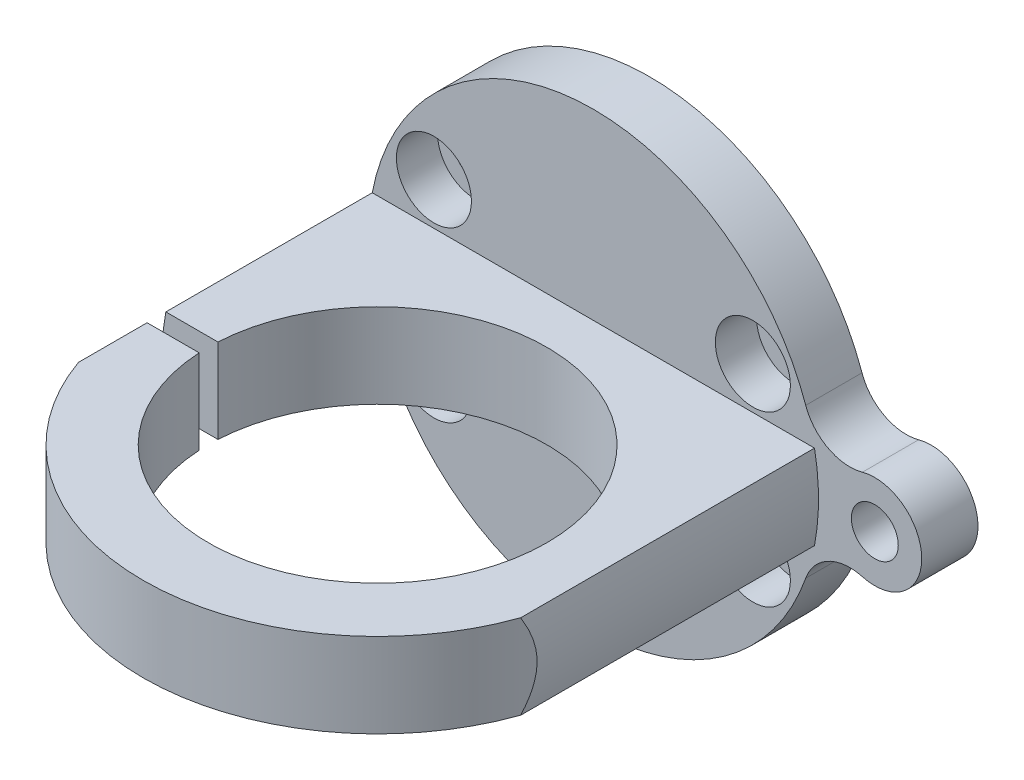
ISO-10303-21;
HEADER;
FILE_DESCRIPTION(('STEP AP214'),'2;1');
FILE_NAME('part.step','',(''),(''),'','','');
FILE_SCHEMA(('AUTOMOTIVE_DESIGN { 1 0 10303 214 1 1 1 1 }'));
ENDSEC;
DATA;
#1=APPLICATION_CONTEXT('core data for automotive mechanical design processes');
#2=APPLICATION_PROTOCOL_DEFINITION('international standard','automotive_design',2000,#1);
#3=PRODUCT_CONTEXT('',#1,'mechanical');
#4=PRODUCT('Part','Part','',(#3));
#5=PRODUCT_RELATED_PRODUCT_CATEGORY('part','',(#4));
#6=PRODUCT_DEFINITION_FORMATION('','',#4);
#7=PRODUCT_DEFINITION_CONTEXT('part definition',#1,'design');
#8=PRODUCT_DEFINITION('design','',#6,#7);
#9=PRODUCT_DEFINITION_SHAPE('','',#8);
#10=(LENGTH_UNIT() NAMED_UNIT(*) SI_UNIT(.MILLI.,.METRE.));
#11=(NAMED_UNIT(*) PLANE_ANGLE_UNIT() SI_UNIT($,.RADIAN.));
#12=(NAMED_UNIT(*) SI_UNIT($,.STERADIAN.) SOLID_ANGLE_UNIT());
#13=UNCERTAINTY_MEASURE_WITH_UNIT(LENGTH_MEASURE(1.E-05),#10,'distance_accuracy_value','');
#14=(GEOMETRIC_REPRESENTATION_CONTEXT(3) GLOBAL_UNCERTAINTY_ASSIGNED_CONTEXT((#13)) GLOBAL_UNIT_ASSIGNED_CONTEXT((#10,
#11,#12)) REPRESENTATION_CONTEXT('',''));
#15=CARTESIAN_POINT('',(0.,0.,0.));
#16=DIRECTION('',(0.,0.,1.));
#17=DIRECTION('',(1.,0.,0.));
#18=AXIS2_PLACEMENT_3D('',#15,#16,#17);
#19=CARTESIAN_POINT('',(0.,0.,-6.));
#20=DIRECTION('',(0.,0.,1.));
#21=DIRECTION('',(1.,0.,0.));
#22=AXIS2_PLACEMENT_3D('',#19,#20,#21);
#23=CYLINDRICAL_SURFACE('',#22,24.);
#24=DIRECTION('',(0.,0.,1.));
#25=VECTOR('',#24,1.);
#26=CARTESIAN_POINT('',(23.5743504682526,-4.5,-6.));
#27=LINE('',#26,#25);
#28=CARTESIAN_POINT('',(23.5743504682526,-4.5,31.3216584885466));
#29=VERTEX_POINT('',#28);
#30=CARTESIAN_POINT('',(23.5743504682526,-4.5,0.));
#31=VERTEX_POINT('',#30);
#32=EDGE_CURVE('E219',#29,#31,#27,.F.);
#33=ORIENTED_EDGE('',*,*,#32,.T.);
#34=CARTESIAN_POINT('',(0.,0.,0.));
#35=DIRECTION('',(0.,0.,1.));
#36=DIRECTION('',(-1.,0.,0.));
#37=AXIS2_PLACEMENT_3D('',#34,#35,#36);
#38=CIRCLE('',#37,24.);
#39=CARTESIAN_POINT('',(23.5743504682526,4.5,0.));
#40=VERTEX_POINT('',#39);
#41=EDGE_CURVE('E161',#31,#40,#38,.T.);
#42=ORIENTED_EDGE('',*,*,#41,.T.);
#43=DIRECTION('',(0.,0.,1.));
#44=VECTOR('',#43,1.);
#45=CARTESIAN_POINT('',(23.5743504682526,4.5,-6.));
#46=LINE('',#45,#44);
#47=CARTESIAN_POINT('',(23.5743504682526,4.5,31.3216584885466));
#48=VERTEX_POINT('',#47);
#49=EDGE_CURVE('E218',#48,#40,#46,.F.);
#50=ORIENTED_EDGE('',*,*,#49,.F.);
#51=CARTESIAN_POINT('',(23.5743504682526,4.5,31.3216584885466));
#52=CARTESIAN_POINT('',(23.6157573192222,4.28301573047034,31.2044104124574));
#53=CARTESIAN_POINT('',(23.6546469507852,4.06307747692704,31.0913980349118));
#54=CARTESIAN_POINT('',(23.7270788362601,3.6162494982413,30.8764465440462));
#55=CARTESIAN_POINT('',(23.7606058100089,3.3893420306107,30.7745393273754));
#56=CARTESIAN_POINT('',(23.8221387533765,2.92591145786183,30.5839248774555));
#57=CARTESIAN_POINT('',(23.8500717825218,2.68930443477932,30.4953953221107));
#58=CARTESIAN_POINT('',(23.8992990807367,2.20942829175013,30.3369201471838));
#59=CARTESIAN_POINT('',(23.9206002093363,1.96616634046176,30.2669553367951));
#60=CARTESIAN_POINT('',(23.9521526056305,1.52702529743059,30.1621717967941));
#61=CARTESIAN_POINT('',(23.9637975166772,1.33228309402099,30.1230239325422));
#62=CARTESIAN_POINT('',(23.9823829053702,0.940112768312964,30.0601979514931));
#63=CARTESIAN_POINT('',(23.9893247646182,0.742685452212207,30.0365152916022));
#64=CARTESIAN_POINT('',(23.9982882648339,0.347726186835377,30.0058846337755));
#65=CARTESIAN_POINT('',(24.0003422165771,0.150203606678098,29.9988267434912));
#66=CARTESIAN_POINT('',(23.9995647437288,-0.244711817262284,30.0014922486172));
#67=CARTESIAN_POINT('',(23.9967334300783,-0.442104663889715,30.0112152629441));
#68=CARTESIAN_POINT('',(23.9862803764371,-0.834761147924739,30.0468922230931));
#69=CARTESIAN_POINT('',(23.9786709585535,-1.03002895178623,30.0728044182715));
#70=CARTESIAN_POINT('',(23.9588737736743,-1.4177874423982,30.1395776867656));
#71=CARTESIAN_POINT('',(23.9466839545981,-1.61027684418988,30.1804454601649));
#72=CARTESIAN_POINT('',(23.9034802076835,-2.18431462097293,30.3234951807389));
#73=CARTESIAN_POINT('',(23.8658903015328,-2.56040118760636,30.4459095987706));
#74=CARTESIAN_POINT('',(23.7872793809115,-3.20017617811185,30.6926830116748));
#75=CARTESIAN_POINT('',(23.7496461115302,-3.46782812056137,30.8083908153243));
#76=CARTESIAN_POINT('',(23.6672030505266,-3.99155750688383,31.0548499962851));
#77=CARTESIAN_POINT('',(23.6224722181626,-4.24772656697199,31.1854318507251));
#78=CARTESIAN_POINT('',(23.5743504682526,-4.5,31.3216584885466));
#79=B_SPLINE_CURVE_WITH_KNOTS('',3,(#51,#52,#53,#54,#55,#56,#57,#58,#59,#60,#61,#62,#63,#64,#65,
#66,#67,#68,#69,#70,#71,#72,#73,#74,#75,#76,#77,#78),.UNSPECIFIED.,.F.,.F.,(4,2,2,2,2,2,2,2,2,2,
2,2,2,4),(0.,0.750439495083586,1.50298057284552,2.26477314161382,3.02577513253489,
3.62211160634237,4.2182728200918,4.81048211830474,5.40267796800572,5.99335285900303,
6.58429269634364,7.77223830948735,8.65367393881817,9.5259146224551),.UNSPECIFIED.);
#80=EDGE_CURVE('E211',#48,#29,#79,.T.);
#81=ORIENTED_EDGE('',*,*,#80,.T.);
#82=EDGE_LOOP('',(#33,#42,#50,#81));
#83=FACE_BOUND('',#82,.T.);
#84=ADVANCED_FACE('F36',(#83),#23,.T.);
#85=CARTESIAN_POINT('',(0.,0.,-6.));
#86=DIRECTION('',(0.,0.,1.));
#87=DIRECTION('',(1.,0.,0.));
#88=AXIS2_PLACEMENT_3D('',#85,#86,#87);
#89=PLANE('',#88);
#90=CARTESIAN_POINT('',(30.,0.,-6.));
#91=DIRECTION('',(0.,0.,1.));
#92=DIRECTION('',(1.,0.,0.));
#93=AXIS2_PLACEMENT_3D('',#90,#91,#92);
#94=CIRCLE('',#93,2.5);
#95=CARTESIAN_POINT('',(32.5,0.,-6.));
#96=VERTEX_POINT('',#95);
#97=EDGE_CURVE('E170',#96,#96,#94,.T.);
#98=ORIENTED_EDGE('',*,*,#97,.T.);
#99=EDGE_LOOP('',(#98));
#100=FACE_BOUND('',#99,.T.);
#101=CARTESIAN_POINT('',(17.,9.,-6.));
#102=DIRECTION('',(0.,0.,1.));
#103=DIRECTION('',(1.,0.,0.));
#104=AXIS2_PLACEMENT_3D('',#101,#102,#103);
#105=CIRCLE('',#104,2.25);
#106=CARTESIAN_POINT('',(19.25,9.,-6.));
#107=VERTEX_POINT('',#106);
#108=EDGE_CURVE('E249',#107,#107,#105,.T.);
#109=ORIENTED_EDGE('',*,*,#108,.T.);
#110=EDGE_LOOP('',(#109));
#111=FACE_BOUND('',#110,.T.);
#112=CARTESIAN_POINT('',(-17.,-9.,-6.));
#113=DIRECTION('',(0.,0.,1.));
#114=DIRECTION('',(1.,0.,0.));
#115=AXIS2_PLACEMENT_3D('',#112,#113,#114);
#116=CIRCLE('',#115,2.25);
#117=CARTESIAN_POINT('',(-14.75,-9.,-6.));
#118=VERTEX_POINT('',#117);
#119=EDGE_CURVE('E261',#118,#118,#116,.T.);
#120=ORIENTED_EDGE('',*,*,#119,.T.);
#121=EDGE_LOOP('',(#120));
#122=FACE_BOUND('',#121,.T.);
#123=CARTESIAN_POINT('',(-17.,9.,-6.));
#124=DIRECTION('',(0.,0.,1.));
#125=DIRECTION('',(1.,0.,0.));
#126=AXIS2_PLACEMENT_3D('',#123,#124,#125);
#127=CIRCLE('',#126,2.25);
#128=CARTESIAN_POINT('',(-14.75,9.,-6.));
#129=VERTEX_POINT('',#128);
#130=EDGE_CURVE('E273',#129,#129,#127,.T.);
#131=ORIENTED_EDGE('',*,*,#130,.T.);
#132=EDGE_LOOP('',(#131));
#133=FACE_BOUND('',#132,.T.);
#134=CARTESIAN_POINT('',(17.,-9.,-6.));
#135=DIRECTION('',(0.,0.,1.));
#136=DIRECTION('',(1.,0.,0.));
#137=AXIS2_PLACEMENT_3D('',#134,#135,#136);
#138=CIRCLE('',#137,2.25);
#139=CARTESIAN_POINT('',(19.25,-9.,-6.));
#140=VERTEX_POINT('',#139);
#141=EDGE_CURVE('E285',#140,#140,#138,.T.);
#142=ORIENTED_EDGE('',*,*,#141,.T.);
#143=EDGE_LOOP('',(#142));
#144=FACE_BOUND('',#143,.T.);
#145=CARTESIAN_POINT('',(0.,0.,-6.));
#146=DIRECTION('',(0.,0.,1.));
#147=DIRECTION('',(1.,0.,0.));
#148=AXIS2_PLACEMENT_3D('',#145,#146,#147);
#149=CIRCLE('',#148,24.);
#150=CARTESIAN_POINT('',(22.6344827586207,7.97998685773998,-6.));
#151=VERTEX_POINT('',#150);
#152=CARTESIAN_POINT('',(22.6344827586207,-7.97998685773998,-6.));
#153=VERTEX_POINT('',#152);
#154=EDGE_CURVE('E315',#151,#153,#149,.T.);
#155=ORIENTED_EDGE('',*,*,#154,.F.);
#156=CARTESIAN_POINT('',(27.35,9.64248411976914,-6.));
#157=DIRECTION('',(0.,0.,1.));
#158=DIRECTION('',(1.,0.,0.));
#159=AXIS2_PLACEMENT_3D('',#156,#157,#158);
#160=CIRCLE('',#159,5.);
#161=CARTESIAN_POINT('',(28.675,4.82124205988457,-6.));
#162=VERTEX_POINT('',#161);
#163=EDGE_CURVE('E168',#151,#162,#160,.T.);
#164=ORIENTED_EDGE('',*,*,#163,.T.);
#165=CARTESIAN_POINT('',(30.,0.,-6.));
#166=DIRECTION('',(0.,0.,-1.));
#167=DIRECTION('',(-1.,0.,0.));
#168=AXIS2_PLACEMENT_3D('',#165,#166,#167);
#169=CIRCLE('',#168,5.);
#170=CARTESIAN_POINT('',(28.675,-4.82124205988457,-6.));
#171=VERTEX_POINT('',#170);
#172=EDGE_CURVE('E146',#162,#171,#169,.T.);
#173=ORIENTED_EDGE('',*,*,#172,.T.);
#174=CARTESIAN_POINT('',(27.35,-9.64248411976914,-6.));
#175=DIRECTION('',(0.,0.,1.));
#176=DIRECTION('',(-1.,0.,0.));
#177=AXIS2_PLACEMENT_3D('',#174,#175,#176);
#178=CIRCLE('',#177,5.);
#179=EDGE_CURVE('E163',#171,#153,#178,.T.);
#180=ORIENTED_EDGE('',*,*,#179,.T.);
#181=EDGE_LOOP('',(#155,#164,#173,#180));
#182=FACE_BOUND('',#181,.T.);
#183=ADVANCED_FACE('F338',(#100,#111,#122,#133,#144,#182),#89,.F.);
#184=CARTESIAN_POINT('',(0.,4.5,24.));
#185=DIRECTION('',(0.,0.,-1.));
#186=DIRECTION('',(-1.,0.,0.));
#187=AXIS2_PLACEMENT_3D('',#184,#185,#186);
#188=PLANE('',#187);
#189=CARTESIAN_POINT('',(-21.5,0.,24.));
#190=DIRECTION('',(0.,0.,-1.));
#191=DIRECTION('',(-1.,0.,0.));
#192=AXIS2_PLACEMENT_3D('',#189,#190,#191);
#193=CIRCLE('',#192,1.69999999999999);
#194=CARTESIAN_POINT('',(-23.2,0.,24.));
#195=VERTEX_POINT('',#194);
#196=EDGE_CURVE('E239',#195,#195,#193,.T.);
#197=ORIENTED_EDGE('',*,*,#196,.F.);
#198=EDGE_LOOP('',(#197));
#199=FACE_BOUND('',#198,.T.);
#200=DIRECTION('',(1.,0.,0.));
#201=VECTOR('',#200,1.);
#202=CARTESIAN_POINT('',(0.,-4.5,24.));
#203=LINE('',#202,#201);
#204=CARTESIAN_POINT('',(-23.5743504682526,-4.5,24.));
#205=VERTEX_POINT('',#204);
#206=CARTESIAN_POINT('',(-18.0222778804456,-4.5,24.));
#207=VERTEX_POINT('',#206);
#208=EDGE_CURVE('E288',#205,#207,#203,.T.);
#209=ORIENTED_EDGE('',*,*,#208,.F.);
#210=CARTESIAN_POINT('',(0.,0.,24.));
#211=DIRECTION('',(0.,0.,-1.));
#212=DIRECTION('',(-1.,0.,0.));
#213=AXIS2_PLACEMENT_3D('',#210,#211,#212);
#214=CIRCLE('',#213,24.);
#215=CARTESIAN_POINT('',(-23.5743504682526,4.5,24.));
#216=VERTEX_POINT('',#215);
#217=EDGE_CURVE('E341',#205,#216,#214,.T.);
#218=ORIENTED_EDGE('',*,*,#217,.T.);
#219=DIRECTION('',(1.,0.,0.));
#220=VECTOR('',#219,1.);
#221=CARTESIAN_POINT('',(0.,4.5,24.));
#222=LINE('',#221,#220);
#223=CARTESIAN_POINT('',(-18.0222778804456,4.5,24.));
#224=VERTEX_POINT('',#223);
#225=EDGE_CURVE('E298',#216,#224,#222,.T.);
#226=ORIENTED_EDGE('',*,*,#225,.T.);
#227=DIRECTION('',(0.,-1.,0.));
#228=VECTOR('',#227,1.);
#229=CARTESIAN_POINT('',(-18.0222778804456,4.5,24.));
#230=LINE('',#229,#228);
#231=EDGE_CURVE('E308',#224,#207,#230,.T.);
#232=ORIENTED_EDGE('',*,*,#231,.T.);
#233=EDGE_LOOP('',(#209,#218,#226,#232));
#234=FACE_BOUND('',#233,.T.);
#235=ADVANCED_FACE('F195',(#199,#234),#188,.T.);
#236=CARTESIAN_POINT('',(0.,4.5,23.));
#237=DIRECTION('',(0.,-1.,0.));
#238=DIRECTION('',(0.,0.,-1.));
#239=AXIS2_PLACEMENT_3D('',#236,#237,#238);
#240=CYLINDRICAL_SURFACE('',#239,25.);
#241=ORIENTED_EDGE('',*,*,#80,.F.);
#242=CARTESIAN_POINT('',(0.,4.5,23.));
#243=DIRECTION('',(0.,1.,0.));
#244=DIRECTION('',(0.,0.,1.));
#245=AXIS2_PLACEMENT_3D('',#242,#243,#244);
#246=CIRCLE('',#245,25.);
#247=CARTESIAN_POINT('',(-23.5743504682526,4.5,31.3216584885466));
#248=VERTEX_POINT('',#247);
#249=EDGE_CURVE('E300',#248,#48,#246,.T.);
#250=ORIENTED_EDGE('',*,*,#249,.F.);
#251=CARTESIAN_POINT('',(-23.5743504682526,-4.5,31.3216584885466));
#252=CARTESIAN_POINT('',(-23.6157573192222,-4.28301573047034,31.2044104124574));
#253=CARTESIAN_POINT('',(-23.6546469507852,-4.06307747692704,31.0913980349118));
#254=CARTESIAN_POINT('',(-23.7270788362601,-3.6162494982413,30.8764465440462));
#255=CARTESIAN_POINT('',(-23.7606058100089,-3.3893420306107,30.7745393273754));
#256=CARTESIAN_POINT('',(-23.8221387533765,-2.92591145786183,30.5839248774555));
#257=CARTESIAN_POINT('',(-23.8500717825218,-2.68930443477932,30.4953953221107));
#258=CARTESIAN_POINT('',(-23.8992990807367,-2.20942829175013,30.3369201471838));
#259=CARTESIAN_POINT('',(-23.9206002093363,-1.96616634046176,30.2669553367951));
#260=CARTESIAN_POINT('',(-23.9521526056305,-1.52702529743059,30.1621717967941));
#261=CARTESIAN_POINT('',(-23.9637975166772,-1.33228309402099,30.1230239325422));
#262=CARTESIAN_POINT('',(-23.9823829053702,-0.940112768312964,30.0601979514931));
#263=CARTESIAN_POINT('',(-23.9893247646182,-0.742685452212207,30.0365152916022));
#264=CARTESIAN_POINT('',(-23.9982882648339,-0.347726186835377,30.0058846337755));
#265=CARTESIAN_POINT('',(-24.0003422165771,-0.150203606678098,29.9988267434912));
#266=CARTESIAN_POINT('',(-23.9995647437288,0.244711817262284,30.0014922486172));
#267=CARTESIAN_POINT('',(-23.9967334300783,0.442104663889715,30.0112152629441));
#268=CARTESIAN_POINT('',(-23.9862803764371,0.834761147924739,30.0468922230931));
#269=CARTESIAN_POINT('',(-23.9786709585535,1.03002895178623,30.0728044182715));
#270=CARTESIAN_POINT('',(-23.9588737736743,1.4177874423982,30.1395776867656));
#271=CARTESIAN_POINT('',(-23.9466839545981,1.61027684418988,30.1804454601649));
#272=CARTESIAN_POINT('',(-23.9034802076835,2.18431462097293,30.3234951807389));
#273=CARTESIAN_POINT('',(-23.8658903015328,2.56040118760636,30.4459095987706));
#274=CARTESIAN_POINT('',(-23.7872793809115,3.20017617811185,30.6926830116748));
#275=CARTESIAN_POINT('',(-23.7496461115302,3.46782812056137,30.8083908153243));
#276=CARTESIAN_POINT('',(-23.6672030505266,3.99155750688383,31.0548499962851));
#277=CARTESIAN_POINT('',(-23.6224722181626,4.24772656697199,31.1854318507251));
#278=CARTESIAN_POINT('',(-23.5743504682526,4.5,31.3216584885466));
#279=B_SPLINE_CURVE_WITH_KNOTS('',3,(#251,#252,#253,#254,#255,#256,#257,#258,#259,#260,#261,
#262,#263,#264,#265,#266,#267,#268,#269,#270,#271,#272,#273,#274,#275,#276,#277,#278),
.UNSPECIFIED.,.F.,.F.,(4,2,2,2,2,2,2,2,2,2,2,2,2,4),(0.,0.750439495083586,1.50298057284552,
2.26477314161382,3.02577513253489,3.62211160634237,4.2182728200918,4.81048211830474,
5.40267796800572,5.99335285900303,6.58429269634364,7.77223830948735,8.65367393881817,
9.5259146224551),.UNSPECIFIED.);
#280=CARTESIAN_POINT('',(-23.8997093023256,2.1917790181339,30.335113854899));
#281=VERTEX_POINT('',#280);
#282=EDGE_CURVE('E187',#281,#248,#279,.T.);
#283=ORIENTED_EDGE('',*,*,#282,.F.);
#284=CARTESIAN_POINT('',(-24.3647286050963,1.53487133634801,28.6));
#285=CARTESIAN_POINT('',(-24.3385334363902,1.58373798265813,28.7139775703707));
#286=CARTESIAN_POINT('',(-24.3114208287813,1.63136154234516,28.8282706371185));
#287=CARTESIAN_POINT('',(-24.2553668314557,1.72436120298112,29.0573145974324));
#288=CARTESIAN_POINT('',(-24.2264255470778,1.76973743311678,29.1720654642713));
#289=CARTESIAN_POINT('',(-24.1667192479999,1.85848378673641,29.4018574256571));
#290=CARTESIAN_POINT('',(-24.1359543539079,1.90185404255247,29.5168985005297));
#291=CARTESIAN_POINT('',(-24.0725976603706,1.98671714979433,29.7471699811742));
#292=CARTESIAN_POINT('',(-24.0400058270598,2.02820996639259,29.8624003904173));
#293=CARTESIAN_POINT('',(-23.9393100191523,2.15021375507858,30.2088397530666));
#294=CARTESIAN_POINT('',(-23.8684386531629,2.22802365182075,30.4402071163822));
#295=CARTESIAN_POINT('',(-23.7192892753877,2.37662100906926,30.9028092297959));
#296=CARTESIAN_POINT('',(-23.6410110560834,2.44740827270812,31.1340439759957));
#297=CARTESIAN_POINT('',(-23.4766649904604,2.5819797772045,31.5969035437314));
#298=CARTESIAN_POINT('',(-23.3905674025857,2.64573504711592,31.8285262592054));
#299=CARTESIAN_POINT('',(-23.2107968478142,2.76538087649977,32.2908790842952));
#300=CARTESIAN_POINT('',(-23.1171236246241,2.82127116971447,32.5216091634351));
#301=CARTESIAN_POINT('',(-22.9222892745375,2.92433317144847,32.9815305834762));
#302=CARTESIAN_POINT('',(-22.821137047292,2.97151501598587,33.2107234102247));
#303=CARTESIAN_POINT('',(-22.6112750435608,3.05620191689344,33.6673974729581));
#304=CARTESIAN_POINT('',(-22.5025667300751,3.0937088399212,33.8948790308764));
#305=CARTESIAN_POINT('',(-22.2927129469009,3.15346785906082,34.3173712534795));
#306=CARTESIAN_POINT('',(-22.1925030920029,3.17708991961985,34.5126522286489));
#307=CARTESIAN_POINT('',(-21.986579255437,3.21507441060415,34.9012044152304));
#308=CARTESIAN_POINT('',(-21.8808656745912,3.22943751431862,35.0944757717714));
#309=CARTESIAN_POINT('',(-21.6639482278379,3.24768976941905,35.478867149361));
#310=CARTESIAN_POINT('',(-21.552735448731,3.25156130884696,35.6699830172825));
#311=CARTESIAN_POINT('',(-21.3253237949323,3.24729477918506,36.0491156352255));
#312=CARTESIAN_POINT('',(-21.2091250542498,3.23915703267695,36.2371324683531));
#313=CARTESIAN_POINT('',(-20.9706323710269,3.20888181418307,36.6118539648462));
#314=CARTESIAN_POINT('',(-20.8482762034527,3.18655154658656,36.7985041706439));
#315=CARTESIAN_POINT('',(-20.5998218237209,3.12546875389362,37.1667451562976));
#316=CARTESIAN_POINT('',(-20.4737221190001,3.08670959448353,37.3483338606121));
#317=CARTESIAN_POINT('',(-20.219847768322,2.99032755726669,37.7039185686807));
#318=CARTESIAN_POINT('',(-20.0920844824312,2.93279886855754,37.8779476659678));
#319=CARTESIAN_POINT('',(-19.8365587552973,2.79579324959464,38.2169597016321));
#320=CARTESIAN_POINT('',(-19.7087965386287,2.71634559253682,38.381954355899));
#321=CARTESIAN_POINT('',(-19.4707375805368,2.54239559939889,38.6819254867493));
#322=CARTESIAN_POINT('',(-19.3601003054575,2.45061373289908,38.8181861350708));
#323=CARTESIAN_POINT('',(-19.1447290497027,2.24443056248103,39.0781791172158));
#324=CARTESIAN_POINT('',(-19.0400001864018,2.13001002593505,39.2019006623855));
#325=CARTESIAN_POINT('',(-18.8402006813346,1.8746945239978,39.4338218573584));
#326=CARTESIAN_POINT('',(-18.7452734361951,1.73347446134265,39.541798600837));
#327=CARTESIAN_POINT('',(-18.6170173774416,1.50287830073305,39.6856482064051));
#328=CARTESIAN_POINT('',(-18.5766455355931,1.42295054418319,39.7305525833018));
#329=CARTESIAN_POINT('',(-18.5015965299608,1.25712090476786,39.8135074774243));
#330=CARTESIAN_POINT('',(-18.4669159121219,1.17122269083133,39.8515621531637));
#331=CARTESIAN_POINT('',(-18.3942550179231,0.965520323854969,39.9308935091991));
#332=CARTESIAN_POINT('',(-18.3587822838977,0.843675800458655,39.9692908576954));
#333=CARTESIAN_POINT('',(-18.3019791685359,0.593006022268458,40.0305410496288));
#334=CARTESIAN_POINT('',(-18.2806393433245,0.464185491365228,40.0534042735246));
#335=CARTESIAN_POINT('',(-18.2536441101458,0.202530080266468,40.0822974575331));
#336=CARTESIAN_POINT('',(-18.2480455110572,0.0696824045964489,40.0882664481666));
#337=CARTESIAN_POINT('',(-18.2531690358145,-0.195331257372771,40.0827934798375));
#338=CARTESIAN_POINT('',(-18.2638911262661,-0.327497245066233,40.0713515564998));
#339=CARTESIAN_POINT('',(-18.2997857819516,-0.580132104902831,40.0328642597361));
#340=CARTESIAN_POINT('',(-18.3241618952024,-0.700849601779827,40.0066785041519));
#341=CARTESIAN_POINT('',(-18.3851161235766,-0.935248491520648,39.9407648066543));
#342=CARTESIAN_POINT('',(-18.4216981858215,-1.04892759421413,39.9010324840036));
#343=CARTESIAN_POINT('',(-18.5185059703771,-1.30272916467186,39.7949863923354));
#344=CARTESIAN_POINT('',(-18.5825520222421,-1.43954007428014,39.7242321919334));
#345=CARTESIAN_POINT('',(-18.7236124047489,-1.69578077295666,39.5661582525348));
#346=CARTESIAN_POINT('',(-18.8006497915181,-1.81517894395756,39.4788090263122));
#347=CARTESIAN_POINT('',(-18.9953384875816,-2.07983857709831,39.2544388639999));
#348=CARTESIAN_POINT('',(-19.1170799216749,-2.21691640392302,39.1113620720405));
#349=CARTESIAN_POINT('',(-19.3690111733188,-2.4601154277705,38.8076102312752));
#350=CARTESIAN_POINT('',(-19.4992153608496,-2.56618219489933,38.646904912899));
#351=CARTESIAN_POINT('',(-19.7335849742352,-2.730937026152,38.34969951951));
#352=CARTESIAN_POINT('',(-19.8372004770122,-2.79491417987831,38.2156175401911));
#353=CARTESIAN_POINT('',(-20.0445365991255,-2.90828109538358,37.941422231395));
#354=CARTESIAN_POINT('',(-20.1482572448508,-2.95766269223846,37.8013055760706));
#355=CARTESIAN_POINT('',(-20.3546270658332,-3.04353829165821,37.516203912168));
#356=CARTESIAN_POINT('',(-20.4572748279482,-3.08001697477782,37.3712133389154));
#357=CARTESIAN_POINT('',(-20.6605532356314,-3.14151248328639,37.0774107993677));
#358=CARTESIAN_POINT('',(-20.7611831588867,-3.1665252719486,36.9285975066736));
#359=CARTESIAN_POINT('',(-21.028557998876,-3.22019759688432,36.5237790991229));
#360=CARTESIAN_POINT('',(-21.1928507388584,-3.23939631071066,36.2648797746961));
#361=CARTESIAN_POINT('',(-21.5120712122413,-3.25390246186473,35.7406896555651));
#362=CARTESIAN_POINT('',(-21.6669925796892,-3.2491938393868,35.4753946836683));
#363=CARTESIAN_POINT('',(-21.9671387732237,-3.21979972896844,34.9389982614785));
#364=CARTESIAN_POINT('',(-22.112318111876,-3.19502675241949,34.667876454317));
#365=CARTESIAN_POINT('',(-22.3917540168518,-3.12856139434019,34.1221995428851));
#366=CARTESIAN_POINT('',(-22.526012031066,-3.086871259999,33.8476448993079));
#367=CARTESIAN_POINT('',(-22.7510189197817,-3.00134194138837,33.3654720794811));
#368=CARTESIAN_POINT('',(-22.8442094432717,-2.96068867437376,33.1584115686668));
#369=CARTESIAN_POINT('',(-23.024388493418,-2.87207618281287,32.743139208142));
#370=CARTESIAN_POINT('',(-23.1113765268117,-2.82411637815202,32.534927268278));
#371=CARTESIAN_POINT('',(-23.2792010830456,-2.7215110412464,32.1175339378097));
#372=CARTESIAN_POINT('',(-23.3600339983459,-2.66686163638435,31.9083520537561));
#373=CARTESIAN_POINT('',(-23.5155247712785,-2.55137985140135,31.4894061361882));
#374=CARTESIAN_POINT('',(-23.5901826653635,-2.49054750778444,31.279642106118));
#375=CARTESIAN_POINT('',(-23.7321613905875,-2.3640734265739,30.8633367699531));
#376=CARTESIAN_POINT('',(-23.7995843907902,-2.29852962468513,30.6568005083532));
#377=CARTESIAN_POINT('',(-23.9285360851068,-2.1618377105549,30.2437537041032));
#378=CARTESIAN_POINT('',(-23.9900650030512,-2.09068981131872,30.037243160774));
#379=CARTESIAN_POINT('',(-24.1071806583825,-1.94268181233978,29.6249294307223));
#380=CARTESIAN_POINT('',(-24.1627757554613,-1.86583001442275,29.419125655013));
#381=CARTESIAN_POINT('',(-24.241792273872,-1.7456720180906,29.1111980682059));
#382=CARTESIAN_POINT('',(-24.2674032519795,-1.70480320842436,29.0086787079431));
#383=CARTESIAN_POINT('',(-24.3171633892363,-1.62124781990399,28.8040214190092));
#384=CARTESIAN_POINT('',(-24.3413124792158,-1.57856115519978,28.7018835086008));
#385=CARTESIAN_POINT('',(-24.3647286050963,-1.53487133634801,28.6));
#386=B_SPLINE_CURVE_WITH_KNOTS('',3,(#284,#285,#286,#287,#288,#289,#290,#291,#292,#293,#294,
#295,#296,#297,#298,#299,#300,#301,#302,#303,#304,#305,#306,#307,#308,#309,#310,#311,#312,#313,
#314,#315,#316,#317,#318,#319,#320,#321,#322,#323,#324,#325,#326,#327,#328,#329,#330,#331,#332,
#333,#334,#335,#336,#337,#338,#339,#340,#341,#342,#343,#344,#345,#346,#347,#348,#349,#350,#351,
#352,#353,#354,#355,#356,#357,#358,#359,#360,#361,#362,#363,#364,#365,#366,#367,#368,#369,#370,
#371,#372,#373,#374,#375,#376,#377,#378,#379,#380,#381,#382,#383,#384,#385),.UNSPECIFIED.,.F.,
.F.,(4,2,2,2,2,2,2,2,2,2,2,2,2,2,2,2,2,2,2,2,2,2,2,2,2,2,2,2,2,2,2,2,2,2,2,2,2,2,2,2,2,2,2,2,2,
2,2,2,2,2,4),(0.,0.38022499631615,0.760428110139757,1.14060610646842,1.52079115241887,
2.28310961627768,3.04544944439374,3.81082112981607,4.57621871959162,5.34071974407243,
6.1050731569332,6.76710712814685,7.42909295240097,8.09218935131156,8.75526793909981,
9.42755232962323,10.100108460999,10.7693401919576,11.4376824420786,12.0304043876406,
12.6236320577199,13.2245784220342,13.5246129919435,13.8244647892915,14.2204615448881,
14.6161934203134,15.0133516398425,15.4105090467383,15.7866054295484,16.1628235512944,
16.6605019664194,17.1590731057889,17.8528988804507,18.5479352303284,19.0905863590734,
19.6335404810961,20.1771370978864,20.7209249486776,21.6411306934085,22.5619546701194,
23.4868155635096,24.4115536432807,25.1033828725627,25.7952670594179,26.4875536900422,
27.1798362336454,27.8604916059669,28.5411211198357,29.2207787270052,29.5606508669504,
29.900539075547),.UNSPECIFIED.);
#387=CARTESIAN_POINT('',(-23.8997093023256,-2.1917790181339,30.335113854899));
#388=VERTEX_POINT('',#387);
#389=EDGE_CURVE('E202',#281,#388,#386,.T.);
#390=ORIENTED_EDGE('',*,*,#389,.T.);
#391=CARTESIAN_POINT('',(-23.5743504682526,-4.5,31.3216584885466));
#392=VERTEX_POINT('',#391);
#393=EDGE_CURVE('E60',#392,#388,#279,.T.);
#394=ORIENTED_EDGE('',*,*,#393,.F.);
#395=CARTESIAN_POINT('',(0.,-4.5,23.));
#396=DIRECTION('',(0.,1.,0.));
#397=DIRECTION('',(0.,0.,1.));
#398=AXIS2_PLACEMENT_3D('',#395,#396,#397);
#399=CIRCLE('',#398,25.);
#400=EDGE_CURVE('E290',#392,#29,#399,.T.);
#401=ORIENTED_EDGE('',*,*,#400,.T.);
#402=EDGE_LOOP('',(#241,#250,#283,#390,#394,#401));
#403=FACE_BOUND('',#402,.T.);
#404=ADVANCED_FACE('F189',(#403),#240,.T.);
#405=CARTESIAN_POINT('',(0.,4.5,22.));
#406=DIRECTION('',(0.,0.,-1.));
#407=DIRECTION('',(-1.,0.,0.));
#408=AXIS2_PLACEMENT_3D('',#405,#406,#407);
#409=PLANE('',#408);
#410=CARTESIAN_POINT('',(-21.5,0.,22.));
#411=DIRECTION('',(0.,0.,1.));
#412=DIRECTION('',(1.,0.,0.));
#413=AXIS2_PLACEMENT_3D('',#410,#411,#412);
#414=CIRCLE('',#413,1.25);
#415=CARTESIAN_POINT('',(-20.25,0.,22.));
#416=VERTEX_POINT('',#415);
#417=EDGE_CURVE('E227',#416,#416,#414,.T.);
#418=ORIENTED_EDGE('',*,*,#417,.F.);
#419=EDGE_LOOP('',(#418));
#420=FACE_BOUND('',#419,.T.);
#421=CARTESIAN_POINT('',(0.,0.,22.));
#422=DIRECTION('',(0.,0.,-1.));
#423=DIRECTION('',(-1.,0.,0.));
#424=AXIS2_PLACEMENT_3D('',#421,#422,#423);
#425=CIRCLE('',#424,24.);
#426=CARTESIAN_POINT('',(-23.5743504682526,-4.5,22.));
#427=VERTEX_POINT('',#426);
#428=CARTESIAN_POINT('',(-23.5743504682526,4.5,22.));
#429=VERTEX_POINT('',#428);
#430=EDGE_CURVE('E224',#427,#429,#425,.T.);
#431=ORIENTED_EDGE('',*,*,#430,.F.);
#432=DIRECTION('',(1.,0.,0.));
#433=VECTOR('',#432,1.);
#434=CARTESIAN_POINT('',(0.,-4.5,22.));
#435=LINE('',#434,#433);
#436=CARTESIAN_POINT('',(-18.0222778804456,-4.5,22.));
#437=VERTEX_POINT('',#436);
#438=EDGE_CURVE('E293',#427,#437,#435,.T.);
#439=ORIENTED_EDGE('',*,*,#438,.T.);
#440=DIRECTION('',(0.,-1.,0.));
#441=VECTOR('',#440,1.);
#442=CARTESIAN_POINT('',(-18.0222778804456,4.5,22.));
#443=LINE('',#442,#441);
#444=CARTESIAN_POINT('',(-18.0222778804456,4.5,22.));
#445=VERTEX_POINT('',#444);
#446=EDGE_CURVE('E311',#445,#437,#443,.T.);
#447=ORIENTED_EDGE('',*,*,#446,.F.);
#448=DIRECTION('',(1.,0.,0.));
#449=VECTOR('',#448,1.);
#450=CARTESIAN_POINT('',(0.,4.5,22.));
#451=LINE('',#450,#449);
#452=EDGE_CURVE('E303',#429,#445,#451,.T.);
#453=ORIENTED_EDGE('',*,*,#452,.F.);
#454=EDGE_LOOP('',(#431,#439,#447,#453));
#455=FACE_BOUND('',#454,.T.);
#456=ADVANCED_FACE('F194',(#420,#455),#409,.F.);
#457=CARTESIAN_POINT('',(0.,4.5,0.));
#458=DIRECTION('',(0.,1.,0.));
#459=DIRECTION('',(0.,0.,1.));
#460=AXIS2_PLACEMENT_3D('',#457,#458,#459);
#461=PLANE('',#460);
#462=DIRECTION('',(-1.,0.,0.));
#463=VECTOR('',#462,1.);
#464=CARTESIAN_POINT('',(0.,4.5,0.));
#465=LINE('',#464,#463);
#466=CARTESIAN_POINT('',(-23.5743504682526,4.5,0.));
#467=VERTEX_POINT('',#466);
#468=EDGE_CURVE('E322',#40,#467,#465,.T.);
#469=ORIENTED_EDGE('',*,*,#468,.T.);
#470=DIRECTION('',(0.,0.,1.));
#471=VECTOR('',#470,1.);
#472=CARTESIAN_POINT('',(-23.5743504682526,4.5,-6.));
#473=LINE('',#472,#471);
#474=EDGE_CURVE('E223',#467,#429,#473,.T.);
#475=ORIENTED_EDGE('',*,*,#474,.T.);
#476=ORIENTED_EDGE('',*,*,#452,.T.);
#477=CARTESIAN_POINT('',(0.,4.5,23.));
#478=DIRECTION('',(0.,1.,0.));
#479=DIRECTION('',(0.,0.,1.));
#480=AXIS2_PLACEMENT_3D('',#477,#478,#479);
#481=CIRCLE('',#480,18.05);
#482=EDGE_CURVE('E305',#224,#445,#481,.T.);
#483=ORIENTED_EDGE('',*,*,#482,.F.);
#484=ORIENTED_EDGE('',*,*,#225,.F.);
#485=EDGE_CURVE('E362',#216,#248,#473,.T.);
#486=ORIENTED_EDGE('',*,*,#485,.T.);
#487=ORIENTED_EDGE('',*,*,#249,.T.);
#488=ORIENTED_EDGE('',*,*,#49,.T.);
#489=EDGE_LOOP('',(#469,#475,#476,#483,#484,#486,#487,#488));
#490=FACE_BOUND('',#489,.T.);
#491=ADVANCED_FACE('F361',(#490),#461,.T.);
#492=CARTESIAN_POINT('',(0.,-4.5,0.));
#493=DIRECTION('',(0.,1.,0.));
#494=DIRECTION('',(0.,0.,1.));
#495=AXIS2_PLACEMENT_3D('',#492,#493,#494);
#496=PLANE('',#495);
#497=DIRECTION('',(0.,0.,1.));
#498=VECTOR('',#497,1.);
#499=CARTESIAN_POINT('',(-23.5743504682526,-4.5,-6.));
#500=LINE('',#499,#498);
#501=CARTESIAN_POINT('',(-23.5743504682526,-4.5,0.));
#502=VERTEX_POINT('',#501);
#503=EDGE_CURVE('E226',#502,#427,#500,.T.);
#504=ORIENTED_EDGE('',*,*,#503,.F.);
#505=DIRECTION('',(-1.,0.,0.));
#506=VECTOR('',#505,1.);
#507=CARTESIAN_POINT('',(0.,-4.5,0.));
#508=LINE('',#507,#506);
#509=EDGE_CURVE('E318',#31,#502,#508,.T.);
#510=ORIENTED_EDGE('',*,*,#509,.F.);
#511=ORIENTED_EDGE('',*,*,#32,.F.);
#512=ORIENTED_EDGE('',*,*,#400,.F.);
#513=EDGE_CURVE('E186',#205,#392,#500,.T.);
#514=ORIENTED_EDGE('',*,*,#513,.F.);
#515=ORIENTED_EDGE('',*,*,#208,.T.);
#516=CARTESIAN_POINT('',(0.,-4.5,23.));
#517=DIRECTION('',(0.,1.,0.));
#518=DIRECTION('',(0.,0.,1.));
#519=AXIS2_PLACEMENT_3D('',#516,#517,#518);
#520=CIRCLE('',#519,18.05);
#521=EDGE_CURVE('E295',#207,#437,#520,.T.);
#522=ORIENTED_EDGE('',*,*,#521,.T.);
#523=ORIENTED_EDGE('',*,*,#438,.F.);
#524=EDGE_LOOP('',(#504,#510,#511,#512,#514,#515,#522,#523));
#525=FACE_BOUND('',#524,.T.);
#526=ADVANCED_FACE('F347',(#525),#496,.F.);
#527=CARTESIAN_POINT('',(-19.8,0.,28.6));
#528=DIRECTION('',(0.,0.,-1.));
#529=DIRECTION('',(-1.,0.,0.));
#530=AXIS2_PLACEMENT_3D('',#527,#528,#529);
#531=PLANE('',#530);
#532=CARTESIAN_POINT('',(-21.5,0.,28.6));
#533=DIRECTION('',(0.,0.,1.));
#534=DIRECTION('',(1.,0.,0.));
#535=AXIS2_PLACEMENT_3D('',#532,#533,#534);
#536=CIRCLE('',#535,1.7);
#537=CARTESIAN_POINT('',(-19.8,0.,28.6));
#538=VERTEX_POINT('',#537);
#539=EDGE_CURVE('E236',#538,#538,#536,.T.);
#540=ORIENTED_EDGE('',*,*,#539,.F.);
#541=EDGE_LOOP('',(#540));
#542=FACE_BOUND('',#541,.T.);
#543=CARTESIAN_POINT('',(0.,0.,28.6));
#544=DIRECTION('',(0.,0.,-1.));
#545=DIRECTION('',(-1.,0.,0.));
#546=AXIS2_PLACEMENT_3D('',#543,#544,#545);
#547=CIRCLE('',#546,24.);
#548=CARTESIAN_POINT('',(-23.8997093023256,-2.1917790181339,28.6));
#549=VERTEX_POINT('',#548);
#550=CARTESIAN_POINT('',(-23.8997093023256,2.1917790181339,28.6));
#551=VERTEX_POINT('',#550);
#552=EDGE_CURVE('E176',#549,#551,#547,.T.);
#553=ORIENTED_EDGE('',*,*,#552,.F.);
#554=CARTESIAN_POINT('',(-21.5,0.,28.6));
#555=DIRECTION('',(0.,0.,1.));
#556=DIRECTION('',(1.,0.,0.));
#557=AXIS2_PLACEMENT_3D('',#554,#555,#556);
#558=CIRCLE('',#557,3.25);
#559=EDGE_CURVE('E233',#549,#551,#558,.T.);
#560=ORIENTED_EDGE('',*,*,#559,.T.);
#561=EDGE_LOOP('',(#553,#560));
#562=FACE_BOUND('',#561,.T.);
#563=ADVANCED_FACE('F396',(#542,#562),#531,.F.);
#564=CARTESIAN_POINT('',(-21.5,0.,44.));
#565=DIRECTION('',(0.,0.,1.));
#566=DIRECTION('',(1.,0.,0.));
#567=AXIS2_PLACEMENT_3D('',#564,#565,#566);
#568=CYLINDRICAL_SURFACE('',#567,3.25);
#569=DIRECTION('',(0.,0.,1.));
#570=VECTOR('',#569,1.);
#571=CARTESIAN_POINT('',(-23.8997093023256,2.1917790181339,21.));
#572=LINE('',#571,#570);
#573=EDGE_CURVE('E12',#551,#281,#572,.T.);
#574=ORIENTED_EDGE('',*,*,#573,.F.);
#575=ORIENTED_EDGE('',*,*,#559,.F.);
#576=DIRECTION('',(0.,0.,1.));
#577=VECTOR('',#576,1.);
#578=CARTESIAN_POINT('',(-23.8997093023256,-2.1917790181339,21.));
#579=LINE('',#578,#577);
#580=EDGE_CURVE('E45',#388,#549,#579,.F.);
#581=ORIENTED_EDGE('',*,*,#580,.F.);
#582=ORIENTED_EDGE('',*,*,#389,.F.);
#583=EDGE_LOOP('',(#574,#575,#581,#582));
#584=FACE_BOUND('',#583,.T.);
#585=ADVANCED_FACE('F389',(#584),#568,.F.);
#586=DIRECTION('',(0.,0.,-1.));
#587=VECTOR('',#586,1.);
#588=CARTESIAN_POINT('',(22.6344827586207,-7.97998685773998,0.));
#589=LINE('',#588,#587);
#590=CARTESIAN_POINT('',(22.6344827586207,-7.97998685773998,0.));
#591=VERTEX_POINT('',#590);
#592=EDGE_CURVE('E174',#591,#153,#589,.T.);
#593=ORIENTED_EDGE('',*,*,#592,.F.);
#594=CARTESIAN_POINT('',(0.,0.,0.));
#595=DIRECTION('',(0.,0.,1.));
#596=DIRECTION('',(1.,0.,0.));
#597=AXIS2_PLACEMENT_3D('',#594,#595,#596);
#598=CIRCLE('',#597,24.);
#599=EDGE_CURVE('E314',#502,#591,#598,.T.);
#600=ORIENTED_EDGE('',*,*,#599,.F.);
#601=ORIENTED_EDGE('',*,*,#503,.T.);
#602=ORIENTED_EDGE('',*,*,#430,.T.);
#603=ORIENTED_EDGE('',*,*,#474,.F.);
#604=CARTESIAN_POINT('',(22.6344827586207,7.97998685773998,0.));
#605=VERTEX_POINT('',#604);
#606=EDGE_CURVE('E319',#605,#467,#598,.T.);
#607=ORIENTED_EDGE('',*,*,#606,.F.);
#608=DIRECTION('',(0.,0.,-1.));
#609=VECTOR('',#608,1.);
#610=CARTESIAN_POINT('',(22.6344827586207,7.97998685773998,0.));
#611=LINE('',#610,#609);
#612=EDGE_CURVE('E150',#605,#151,#611,.T.);
#613=ORIENTED_EDGE('',*,*,#612,.T.);
#614=ORIENTED_EDGE('',*,*,#154,.T.);
#615=EDGE_LOOP('',(#593,#600,#601,#602,#603,#607,#613,#614));
#616=FACE_BOUND('',#615,.T.);
#617=ADVANCED_FACE('F38',(#616),#23,.T.);
#618=CARTESIAN_POINT('',(0.,0.,0.));
#619=DIRECTION('',(0.,0.,1.));
#620=DIRECTION('',(1.,0.,0.));
#621=AXIS2_PLACEMENT_3D('',#618,#619,#620);
#622=PLANE('',#621);
#623=CARTESIAN_POINT('',(30.,0.,0.));
#624=DIRECTION('',(0.,0.,1.));
#625=DIRECTION('',(1.,0.,0.));
#626=AXIS2_PLACEMENT_3D('',#623,#624,#625);
#627=CIRCLE('',#626,2.5);
#628=CARTESIAN_POINT('',(32.5,0.,0.));
#629=VERTEX_POINT('',#628);
#630=EDGE_CURVE('E613',#629,#629,#627,.T.);
#631=ORIENTED_EDGE('',*,*,#630,.F.);
#632=EDGE_LOOP('',(#631));
#633=FACE_BOUND('',#632,.T.);
#634=CARTESIAN_POINT('',(17.,9.,0.));
#635=DIRECTION('',(0.,0.,1.));
#636=DIRECTION('',(1.,0.,0.));
#637=AXIS2_PLACEMENT_3D('',#634,#635,#636);
#638=CIRCLE('',#637,4.);
#639=CARTESIAN_POINT('',(21.,9.,0.));
#640=VERTEX_POINT('',#639);
#641=EDGE_CURVE('E240',#640,#640,#638,.T.);
#642=ORIENTED_EDGE('',*,*,#641,.F.);
#643=EDGE_LOOP('',(#642));
#644=FACE_BOUND('',#643,.T.);
#645=CARTESIAN_POINT('',(-17.,9.,0.));
#646=DIRECTION('',(0.,0.,1.));
#647=DIRECTION('',(1.,0.,0.));
#648=AXIS2_PLACEMENT_3D('',#645,#646,#647);
#649=CIRCLE('',#648,4.);
#650=CARTESIAN_POINT('',(-13.,9.,0.));
#651=VERTEX_POINT('',#650);
#652=EDGE_CURVE('E264',#651,#651,#649,.T.);
#653=ORIENTED_EDGE('',*,*,#652,.F.);
#654=EDGE_LOOP('',(#653));
#655=FACE_BOUND('',#654,.T.);
#656=ORIENTED_EDGE('',*,*,#468,.F.);
#657=ORIENTED_EDGE('',*,*,#41,.F.);
#658=ORIENTED_EDGE('',*,*,#509,.T.);
#659=ORIENTED_EDGE('',*,*,#599,.T.);
#660=CARTESIAN_POINT('',(27.35,-9.64248411976914,0.));
#661=DIRECTION('',(0.,0.,1.));
#662=DIRECTION('',(-1.,0.,0.));
#663=AXIS2_PLACEMENT_3D('',#660,#661,#662);
#664=CIRCLE('',#663,5.);
#665=CARTESIAN_POINT('',(28.675,-4.82124205988457,0.));
#666=VERTEX_POINT('',#665);
#667=EDGE_CURVE('E156',#666,#591,#664,.T.);
#668=ORIENTED_EDGE('',*,*,#667,.F.);
#669=CARTESIAN_POINT('',(30.,0.,0.));
#670=DIRECTION('',(0.,0.,-1.));
#671=DIRECTION('',(-1.,0.,0.));
#672=AXIS2_PLACEMENT_3D('',#669,#670,#671);
#673=CIRCLE('',#672,5.);
#674=CARTESIAN_POINT('',(28.675,4.82124205988457,0.));
#675=VERTEX_POINT('',#674);
#676=EDGE_CURVE('E143',#675,#666,#673,.T.);
#677=ORIENTED_EDGE('',*,*,#676,.F.);
#678=CARTESIAN_POINT('',(27.35,9.64248411976914,0.));
#679=DIRECTION('',(0.,0.,1.));
#680=DIRECTION('',(1.,0.,0.));
#681=AXIS2_PLACEMENT_3D('',#678,#679,#680);
#682=CIRCLE('',#681,5.);
#683=EDGE_CURVE('E52',#605,#675,#682,.T.);
#684=ORIENTED_EDGE('',*,*,#683,.F.);
#685=ORIENTED_EDGE('',*,*,#606,.T.);
#686=EDGE_LOOP('',(#656,#657,#658,#659,#668,#677,#684,#685));
#687=FACE_BOUND('',#686,.T.);
#688=CARTESIAN_POINT('',(-17.,-9.,0.));
#689=DIRECTION('',(0.,0.,1.));
#690=DIRECTION('',(1.,0.,0.));
#691=AXIS2_PLACEMENT_3D('',#688,#689,#690);
#692=CIRCLE('',#691,4.);
#693=CARTESIAN_POINT('',(-13.,-9.,0.));
#694=VERTEX_POINT('',#693);
#695=EDGE_CURVE('E252',#694,#694,#692,.T.);
#696=ORIENTED_EDGE('',*,*,#695,.F.);
#697=EDGE_LOOP('',(#696));
#698=FACE_BOUND('',#697,.T.);
#699=CARTESIAN_POINT('',(17.,-9.,0.));
#700=DIRECTION('',(0.,0.,1.));
#701=DIRECTION('',(1.,0.,0.));
#702=AXIS2_PLACEMENT_3D('',#699,#700,#701);
#703=CIRCLE('',#702,4.);
#704=CARTESIAN_POINT('',(21.,-9.,0.));
#705=VERTEX_POINT('',#704);
#706=EDGE_CURVE('E276',#705,#705,#703,.T.);
#707=ORIENTED_EDGE('',*,*,#706,.F.);
#708=EDGE_LOOP('',(#707));
#709=FACE_BOUND('',#708,.T.);
#710=ADVANCED_FACE('F153',(#633,#644,#655,#687,#698,#709),#622,.T.);
#711=CARTESIAN_POINT('',(0.,4.5,23.));
#712=DIRECTION('',(0.,-1.,0.));
#713=DIRECTION('',(0.,0.,-1.));
#714=AXIS2_PLACEMENT_3D('',#711,#712,#713);
#715=CYLINDRICAL_SURFACE('',#714,18.05);
#716=ORIENTED_EDGE('',*,*,#446,.T.);
#717=ORIENTED_EDGE('',*,*,#521,.F.);
#718=ORIENTED_EDGE('',*,*,#231,.F.);
#719=ORIENTED_EDGE('',*,*,#482,.T.);
#720=EDGE_LOOP('',(#716,#717,#718,#719));
#721=FACE_BOUND('',#720,.T.);
#722=ADVANCED_FACE('F394',(#721),#715,.F.);
#723=CARTESIAN_POINT('',(17.,-9.,0.));
#724=DIRECTION('',(0.,0.,1.));
#725=DIRECTION('',(1.,0.,0.));
#726=AXIS2_PLACEMENT_3D('',#723,#724,#725);
#727=CYLINDRICAL_SURFACE('',#726,2.25);
#728=ORIENTED_EDGE('',*,*,#141,.F.);
#729=EDGE_LOOP('',(#728));
#730=FACE_BOUND('',#729,.T.);
#731=CARTESIAN_POINT('',(17.,-9.,-4.4));
#732=DIRECTION('',(0.,0.,1.));
#733=DIRECTION('',(1.,0.,0.));
#734=AXIS2_PLACEMENT_3D('',#731,#732,#733);
#735=CIRCLE('',#734,2.25);
#736=CARTESIAN_POINT('',(19.25,-9.,-4.4));
#737=VERTEX_POINT('',#736);
#738=EDGE_CURVE('E282',#737,#737,#735,.T.);
#739=ORIENTED_EDGE('',*,*,#738,.T.);
#740=EDGE_LOOP('',(#739));
#741=FACE_BOUND('',#740,.T.);
#742=ADVANCED_FACE('F454',(#730,#741),#727,.F.);
#743=CARTESIAN_POINT('',(19.25,-9.,-4.4));
#744=DIRECTION('',(0.,0.,-1.));
#745=DIRECTION('',(-1.,0.,0.));
#746=AXIS2_PLACEMENT_3D('',#743,#744,#745);
#747=PLANE('',#746);
#748=ORIENTED_EDGE('',*,*,#738,.F.);
#749=EDGE_LOOP('',(#748));
#750=FACE_BOUND('',#749,.T.);
#751=CARTESIAN_POINT('',(17.,-9.,-4.4));
#752=DIRECTION('',(0.,0.,1.));
#753=DIRECTION('',(1.,0.,0.));
#754=AXIS2_PLACEMENT_3D('',#751,#752,#753);
#755=CIRCLE('',#754,4.);
#756=CARTESIAN_POINT('',(21.,-9.,-4.4));
#757=VERTEX_POINT('',#756);
#758=EDGE_CURVE('E279',#757,#757,#755,.T.);
#759=ORIENTED_EDGE('',*,*,#758,.T.);
#760=EDGE_LOOP('',(#759));
#761=FACE_BOUND('',#760,.T.);
#762=ADVANCED_FACE('F450',(#750,#761),#747,.F.);
#763=CARTESIAN_POINT('',(17.,-9.,0.));
#764=DIRECTION('',(0.,0.,1.));
#765=DIRECTION('',(1.,0.,0.));
#766=AXIS2_PLACEMENT_3D('',#763,#764,#765);
#767=CYLINDRICAL_SURFACE('',#766,4.);
#768=ORIENTED_EDGE('',*,*,#758,.F.);
#769=EDGE_LOOP('',(#768));
#770=FACE_BOUND('',#769,.T.);
#771=ORIENTED_EDGE('',*,*,#706,.T.);
#772=EDGE_LOOP('',(#771));
#773=FACE_BOUND('',#772,.T.);
#774=ADVANCED_FACE('F446',(#770,#773),#767,.F.);
#775=CARTESIAN_POINT('',(-17.,9.,0.));
#776=DIRECTION('',(0.,0.,1.));
#777=DIRECTION('',(1.,0.,0.));
#778=AXIS2_PLACEMENT_3D('',#775,#776,#777);
#779=CYLINDRICAL_SURFACE('',#778,2.25);
#780=ORIENTED_EDGE('',*,*,#130,.F.);
#781=EDGE_LOOP('',(#780));
#782=FACE_BOUND('',#781,.T.);
#783=CARTESIAN_POINT('',(-17.,9.,-4.4));
#784=DIRECTION('',(0.,0.,1.));
#785=DIRECTION('',(1.,0.,0.));
#786=AXIS2_PLACEMENT_3D('',#783,#784,#785);
#787=CIRCLE('',#786,2.25);
#788=CARTESIAN_POINT('',(-14.75,9.,-4.4));
#789=VERTEX_POINT('',#788);
#790=EDGE_CURVE('E270',#789,#789,#787,.T.);
#791=ORIENTED_EDGE('',*,*,#790,.T.);
#792=EDGE_LOOP('',(#791));
#793=FACE_BOUND('',#792,.T.);
#794=ADVANCED_FACE('F442',(#782,#793),#779,.F.);
#795=CARTESIAN_POINT('',(-14.75,9.,-4.4));
#796=DIRECTION('',(0.,0.,-1.));
#797=DIRECTION('',(-1.,0.,0.));
#798=AXIS2_PLACEMENT_3D('',#795,#796,#797);
#799=PLANE('',#798);
#800=ORIENTED_EDGE('',*,*,#790,.F.);
#801=EDGE_LOOP('',(#800));
#802=FACE_BOUND('',#801,.T.);
#803=CARTESIAN_POINT('',(-17.,9.,-4.4));
#804=DIRECTION('',(0.,0.,1.));
#805=DIRECTION('',(1.,0.,0.));
#806=AXIS2_PLACEMENT_3D('',#803,#804,#805);
#807=CIRCLE('',#806,4.);
#808=CARTESIAN_POINT('',(-13.,9.,-4.4));
#809=VERTEX_POINT('',#808);
#810=EDGE_CURVE('E267',#809,#809,#807,.T.);
#811=ORIENTED_EDGE('',*,*,#810,.T.);
#812=EDGE_LOOP('',(#811));
#813=FACE_BOUND('',#812,.T.);
#814=ADVANCED_FACE('F438',(#802,#813),#799,.F.);
#815=CARTESIAN_POINT('',(-17.,9.,0.));
#816=DIRECTION('',(0.,0.,1.));
#817=DIRECTION('',(1.,0.,0.));
#818=AXIS2_PLACEMENT_3D('',#815,#816,#817);
#819=CYLINDRICAL_SURFACE('',#818,4.);
#820=ORIENTED_EDGE('',*,*,#810,.F.);
#821=EDGE_LOOP('',(#820));
#822=FACE_BOUND('',#821,.T.);
#823=ORIENTED_EDGE('',*,*,#652,.T.);
#824=EDGE_LOOP('',(#823));
#825=FACE_BOUND('',#824,.T.);
#826=ADVANCED_FACE('F434',(#822,#825),#819,.F.);
#827=CARTESIAN_POINT('',(-17.,-9.,0.));
#828=DIRECTION('',(0.,0.,1.));
#829=DIRECTION('',(1.,0.,0.));
#830=AXIS2_PLACEMENT_3D('',#827,#828,#829);
#831=CYLINDRICAL_SURFACE('',#830,2.25);
#832=ORIENTED_EDGE('',*,*,#119,.F.);
#833=EDGE_LOOP('',(#832));
#834=FACE_BOUND('',#833,.T.);
#835=CARTESIAN_POINT('',(-17.,-9.,-4.4));
#836=DIRECTION('',(0.,0.,1.));
#837=DIRECTION('',(1.,0.,0.));
#838=AXIS2_PLACEMENT_3D('',#835,#836,#837);
#839=CIRCLE('',#838,2.25);
#840=CARTESIAN_POINT('',(-14.75,-9.,-4.4));
#841=VERTEX_POINT('',#840);
#842=EDGE_CURVE('E258',#841,#841,#839,.T.);
#843=ORIENTED_EDGE('',*,*,#842,.T.);
#844=EDGE_LOOP('',(#843));
#845=FACE_BOUND('',#844,.T.);
#846=ADVANCED_FACE('F430',(#834,#845),#831,.F.);
#847=CARTESIAN_POINT('',(-14.75,-9.,-4.4));
#848=DIRECTION('',(0.,0.,-1.));
#849=DIRECTION('',(-1.,0.,0.));
#850=AXIS2_PLACEMENT_3D('',#847,#848,#849);
#851=PLANE('',#850);
#852=ORIENTED_EDGE('',*,*,#842,.F.);
#853=EDGE_LOOP('',(#852));
#854=FACE_BOUND('',#853,.T.);
#855=CARTESIAN_POINT('',(-17.,-9.,-4.4));
#856=DIRECTION('',(0.,0.,1.));
#857=DIRECTION('',(1.,0.,0.));
#858=AXIS2_PLACEMENT_3D('',#855,#856,#857);
#859=CIRCLE('',#858,4.);
#860=CARTESIAN_POINT('',(-13.,-9.,-4.4));
#861=VERTEX_POINT('',#860);
#862=EDGE_CURVE('E255',#861,#861,#859,.T.);
#863=ORIENTED_EDGE('',*,*,#862,.T.);
#864=EDGE_LOOP('',(#863));
#865=FACE_BOUND('',#864,.T.);
#866=ADVANCED_FACE('F426',(#854,#865),#851,.F.);
#867=CARTESIAN_POINT('',(-17.,-9.,0.));
#868=DIRECTION('',(0.,0.,1.));
#869=DIRECTION('',(1.,0.,0.));
#870=AXIS2_PLACEMENT_3D('',#867,#868,#869);
#871=CYLINDRICAL_SURFACE('',#870,4.);
#872=ORIENTED_EDGE('',*,*,#862,.F.);
#873=EDGE_LOOP('',(#872));
#874=FACE_BOUND('',#873,.T.);
#875=ORIENTED_EDGE('',*,*,#695,.T.);
#876=EDGE_LOOP('',(#875));
#877=FACE_BOUND('',#876,.T.);
#878=ADVANCED_FACE('F422',(#874,#877),#871,.F.);
#879=CARTESIAN_POINT('',(17.,9.,0.));
#880=DIRECTION('',(0.,0.,1.));
#881=DIRECTION('',(1.,0.,0.));
#882=AXIS2_PLACEMENT_3D('',#879,#880,#881);
#883=CYLINDRICAL_SURFACE('',#882,2.25);
#884=ORIENTED_EDGE('',*,*,#108,.F.);
#885=EDGE_LOOP('',(#884));
#886=FACE_BOUND('',#885,.T.);
#887=CARTESIAN_POINT('',(17.,9.,-4.4));
#888=DIRECTION('',(0.,0.,1.));
#889=DIRECTION('',(1.,0.,0.));
#890=AXIS2_PLACEMENT_3D('',#887,#888,#889);
#891=CIRCLE('',#890,2.25);
#892=CARTESIAN_POINT('',(19.25,9.,-4.4));
#893=VERTEX_POINT('',#892);
#894=EDGE_CURVE('E246',#893,#893,#891,.T.);
#895=ORIENTED_EDGE('',*,*,#894,.T.);
#896=EDGE_LOOP('',(#895));
#897=FACE_BOUND('',#896,.T.);
#898=ADVANCED_FACE('F418',(#886,#897),#883,.F.);
#899=CARTESIAN_POINT('',(19.25,9.,-4.4));
#900=DIRECTION('',(0.,0.,-1.));
#901=DIRECTION('',(-1.,0.,0.));
#902=AXIS2_PLACEMENT_3D('',#899,#900,#901);
#903=PLANE('',#902);
#904=ORIENTED_EDGE('',*,*,#894,.F.);
#905=EDGE_LOOP('',(#904));
#906=FACE_BOUND('',#905,.T.);
#907=CARTESIAN_POINT('',(17.,9.,-4.4));
#908=DIRECTION('',(0.,0.,1.));
#909=DIRECTION('',(1.,0.,0.));
#910=AXIS2_PLACEMENT_3D('',#907,#908,#909);
#911=CIRCLE('',#910,4.);
#912=CARTESIAN_POINT('',(21.,9.,-4.4));
#913=VERTEX_POINT('',#912);
#914=EDGE_CURVE('E243',#913,#913,#911,.T.);
#915=ORIENTED_EDGE('',*,*,#914,.T.);
#916=EDGE_LOOP('',(#915));
#917=FACE_BOUND('',#916,.T.);
#918=ADVANCED_FACE('F414',(#906,#917),#903,.F.);
#919=CARTESIAN_POINT('',(17.,9.,0.));
#920=DIRECTION('',(0.,0.,1.));
#921=DIRECTION('',(1.,0.,0.));
#922=AXIS2_PLACEMENT_3D('',#919,#920,#921);
#923=CYLINDRICAL_SURFACE('',#922,4.);
#924=ORIENTED_EDGE('',*,*,#914,.F.);
#925=EDGE_LOOP('',(#924));
#926=FACE_BOUND('',#925,.T.);
#927=ORIENTED_EDGE('',*,*,#641,.T.);
#928=EDGE_LOOP('',(#927));
#929=FACE_BOUND('',#928,.T.);
#930=ADVANCED_FACE('F411',(#926,#929),#923,.F.);
#931=CARTESIAN_POINT('',(-21.5,0.,44.));
#932=DIRECTION('',(0.,0.,1.));
#933=DIRECTION('',(1.,0.,0.));
#934=AXIS2_PLACEMENT_3D('',#931,#932,#933);
#935=CYLINDRICAL_SURFACE('',#934,1.69999999999999);
#936=ORIENTED_EDGE('',*,*,#196,.T.);
#937=EDGE_LOOP('',(#936));
#938=FACE_BOUND('',#937,.T.);
#939=ORIENTED_EDGE('',*,*,#539,.T.);
#940=EDGE_LOOP('',(#939));
#941=FACE_BOUND('',#940,.T.);
#942=ADVANCED_FACE('F333',(#938,#941),#935,.F.);
#943=CARTESIAN_POINT('',(-21.5,0.,12.));
#944=DIRECTION('',(0.,0.,1.));
#945=DIRECTION('',(1.,0.,0.));
#946=AXIS2_PLACEMENT_3D('',#943,#944,#945);
#947=CONICAL_SURFACE('',#946,1.25,1.02974425867665);
#948=CARTESIAN_POINT('',(-21.5,0.,11.2489242262155));
#949=VERTEX_POINT('',#948);
#950=VERTEX_LOOP('',#949);
#951=FACE_BOUND('',#950,.T.);
#952=CARTESIAN_POINT('',(-21.5,0.,12.));
#953=DIRECTION('',(0.,0.,1.));
#954=DIRECTION('',(1.,0.,0.));
#955=AXIS2_PLACEMENT_3D('',#952,#953,#954);
#956=CIRCLE('',#955,1.25);
#957=CARTESIAN_POINT('',(-20.25,0.,12.));
#958=VERTEX_POINT('',#957);
#959=EDGE_CURVE('E230',#958,#958,#956,.T.);
#960=ORIENTED_EDGE('',*,*,#959,.T.);
#961=EDGE_LOOP('',(#960));
#962=FACE_BOUND('',#961,.T.);
#963=ADVANCED_FACE('F406',(#951,#962),#947,.F.);
#964=CARTESIAN_POINT('',(-21.5,0.,22.));
#965=DIRECTION('',(0.,0.,1.));
#966=DIRECTION('',(1.,0.,0.));
#967=AXIS2_PLACEMENT_3D('',#964,#965,#966);
#968=CYLINDRICAL_SURFACE('',#967,1.25);
#969=ORIENTED_EDGE('',*,*,#959,.F.);
#970=EDGE_LOOP('',(#969));
#971=FACE_BOUND('',#970,.T.);
#972=ORIENTED_EDGE('',*,*,#417,.T.);
#973=EDGE_LOOP('',(#972));
#974=FACE_BOUND('',#973,.T.);
#975=ADVANCED_FACE('F381',(#971,#974),#968,.F.);
#976=ORIENTED_EDGE('',*,*,#217,.F.);
#977=ORIENTED_EDGE('',*,*,#513,.T.);
#978=ORIENTED_EDGE('',*,*,#393,.T.);
#979=ORIENTED_EDGE('',*,*,#580,.T.);
#980=ORIENTED_EDGE('',*,*,#552,.T.);
#981=ORIENTED_EDGE('',*,*,#573,.T.);
#982=ORIENTED_EDGE('',*,*,#282,.T.);
#983=ORIENTED_EDGE('',*,*,#485,.F.);
#984=EDGE_LOOP('',(#976,#977,#978,#979,#980,#981,#982,#983));
#985=FACE_BOUND('',#984,.T.);
#986=ADVANCED_FACE('F374',(#985),#23,.T.);
#987=CARTESIAN_POINT('',(27.35,-9.64248411976914,0.));
#988=DIRECTION('',(0.,0.,-1.));
#989=DIRECTION('',(-1.,0.,0.));
#990=AXIS2_PLACEMENT_3D('',#987,#988,#989);
#991=CYLINDRICAL_SURFACE('',#990,5.);
#992=ORIENTED_EDGE('',*,*,#179,.F.);
#993=DIRECTION('',(0.,0.,-1.));
#994=VECTOR('',#993,1.);
#995=CARTESIAN_POINT('',(28.675,-4.82124205988457,0.));
#996=LINE('',#995,#994);
#997=EDGE_CURVE('E149',#666,#171,#996,.T.);
#998=ORIENTED_EDGE('',*,*,#997,.F.);
#999=ORIENTED_EDGE('',*,*,#667,.T.);
#1000=ORIENTED_EDGE('',*,*,#592,.T.);
#1001=EDGE_LOOP('',(#992,#998,#999,#1000));
#1002=FACE_BOUND('',#1001,.T.);
#1003=ADVANCED_FACE('F372',(#1002),#991,.F.);
#1004=CARTESIAN_POINT('',(30.,0.,0.));
#1005=DIRECTION('',(0.,0.,-1.));
#1006=DIRECTION('',(-1.,0.,0.));
#1007=AXIS2_PLACEMENT_3D('',#1004,#1005,#1006);
#1008=CYLINDRICAL_SURFACE('',#1007,5.);
#1009=ORIENTED_EDGE('',*,*,#172,.F.);
#1010=DIRECTION('',(0.,0.,-1.));
#1011=VECTOR('',#1010,1.);
#1012=CARTESIAN_POINT('',(28.675,4.82124205988457,0.));
#1013=LINE('',#1012,#1011);
#1014=EDGE_CURVE('E141',#675,#162,#1013,.T.);
#1015=ORIENTED_EDGE('',*,*,#1014,.F.);
#1016=ORIENTED_EDGE('',*,*,#676,.T.);
#1017=ORIENTED_EDGE('',*,*,#997,.T.);
#1018=EDGE_LOOP('',(#1009,#1015,#1016,#1017));
#1019=FACE_BOUND('',#1018,.T.);
#1020=ADVANCED_FACE('F142',(#1019),#1008,.T.);
#1021=CARTESIAN_POINT('',(27.35,9.64248411976914,0.));
#1022=DIRECTION('',(0.,0.,-1.));
#1023=DIRECTION('',(-1.,0.,0.));
#1024=AXIS2_PLACEMENT_3D('',#1021,#1022,#1023);
#1025=CYLINDRICAL_SURFACE('',#1024,5.);
#1026=ORIENTED_EDGE('',*,*,#163,.F.);
#1027=ORIENTED_EDGE('',*,*,#612,.F.);
#1028=ORIENTED_EDGE('',*,*,#683,.T.);
#1029=ORIENTED_EDGE('',*,*,#1014,.T.);
#1030=EDGE_LOOP('',(#1026,#1027,#1028,#1029));
#1031=FACE_BOUND('',#1030,.T.);
#1032=ADVANCED_FACE('F158',(#1031),#1025,.F.);
#1033=CARTESIAN_POINT('',(30.,0.,0.));
#1034=DIRECTION('',(0.,0.,1.));
#1035=DIRECTION('',(1.,0.,0.));
#1036=AXIS2_PLACEMENT_3D('',#1033,#1034,#1035);
#1037=CYLINDRICAL_SURFACE('',#1036,2.5);
#1038=ORIENTED_EDGE('',*,*,#97,.F.);
#1039=EDGE_LOOP('',(#1038));
#1040=FACE_BOUND('',#1039,.T.);
#1041=ORIENTED_EDGE('',*,*,#630,.T.);
#1042=EDGE_LOOP('',(#1041));
#1043=FACE_BOUND('',#1042,.T.);
#1044=ADVANCED_FACE('F587',(#1040,#1043),#1037,.F.);
#1045=CLOSED_SHELL('',(#84,#183,#235,#404,#456,#491,#526,#563,#585,#617,#710,#722,#742,#762,
#774,#794,#814,#826,#846,#866,#878,#898,#918,#930,#942,#963,#975,#986,#1003,#1020,#1032,#1044));
#1046=MANIFOLD_SOLID_BREP('B2',#1045);
#1047=ADVANCED_BREP_SHAPE_REPRESENTATION('',(#18,#1046),#14);
#1048=SHAPE_DEFINITION_REPRESENTATION(#9,#1047);
ENDSEC;
END-ISO-10303-21;
